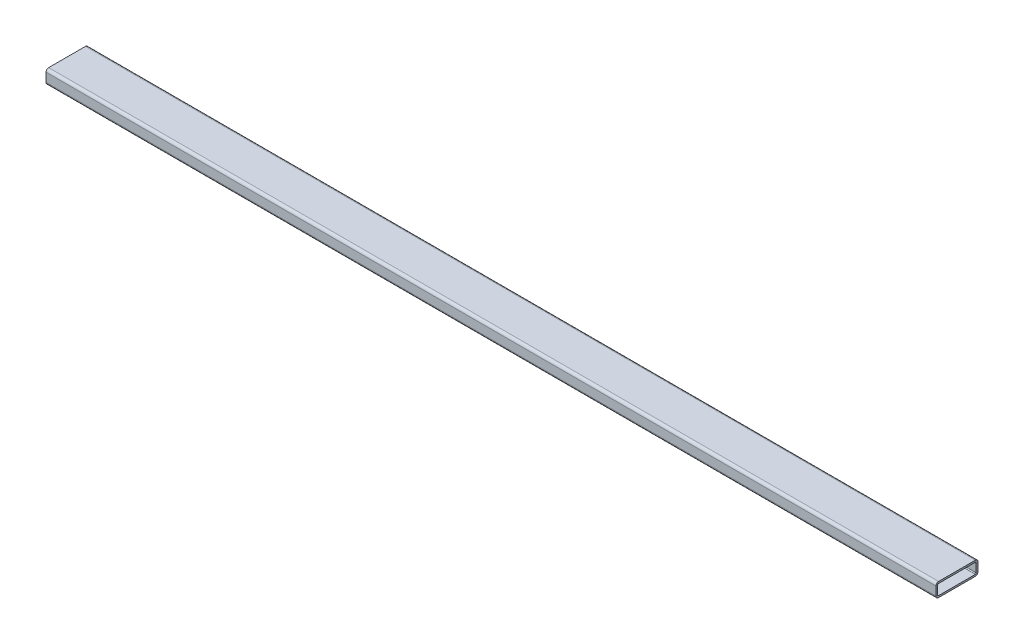
ISO-10303-21;
HEADER;
FILE_DESCRIPTION(('STEP AP214'),'2;1');
FILE_NAME('part.step','',(''),(''),'','','');
FILE_SCHEMA(('AUTOMOTIVE_DESIGN { 1 0 10303 214 1 1 1 1 }'));
ENDSEC;
DATA;
#1=APPLICATION_CONTEXT('core data for automotive mechanical design processes');
#2=APPLICATION_PROTOCOL_DEFINITION('international standard','automotive_design',2000,#1);
#3=PRODUCT_CONTEXT('',#1,'mechanical');
#4=PRODUCT('Part','Part','',(#3));
#5=PRODUCT_RELATED_PRODUCT_CATEGORY('part','',(#4));
#6=PRODUCT_DEFINITION_FORMATION('','',#4);
#7=PRODUCT_DEFINITION_CONTEXT('part definition',#1,'design');
#8=PRODUCT_DEFINITION('design','',#6,#7);
#9=PRODUCT_DEFINITION_SHAPE('','',#8);
#10=(LENGTH_UNIT() NAMED_UNIT(*) SI_UNIT(.MILLI.,.METRE.));
#11=(NAMED_UNIT(*) PLANE_ANGLE_UNIT() SI_UNIT($,.RADIAN.));
#12=(NAMED_UNIT(*) SI_UNIT($,.STERADIAN.) SOLID_ANGLE_UNIT());
#13=UNCERTAINTY_MEASURE_WITH_UNIT(LENGTH_MEASURE(1.E-05),#10,'distance_accuracy_value','');
#14=(GEOMETRIC_REPRESENTATION_CONTEXT(3) GLOBAL_UNCERTAINTY_ASSIGNED_CONTEXT((#13)) GLOBAL_UNIT_ASSIGNED_CONTEXT((#10,
#11,#12)) REPRESENTATION_CONTEXT('',''));
#15=CARTESIAN_POINT('',(0.,0.,0.));
#16=DIRECTION('',(0.,0.,1.));
#17=DIRECTION('',(1.,0.,0.));
#18=AXIS2_PLACEMENT_3D('',#15,#16,#17);
#19=CARTESIAN_POINT('',(806.45,20.6248,-33.3248));
#20=DIRECTION('',(1.,0.,0.));
#21=DIRECTION('',(0.,0.,-1.));
#22=AXIS2_PLACEMENT_3D('',#19,#20,#21);
#23=PLANE('',#22);
#24=CARTESIAN_POINT('',(806.45,20.6248,-33.3248));
#25=DIRECTION('',(1.,0.,0.));
#26=DIRECTION('',(0.,0.,-1.));
#27=AXIS2_PLACEMENT_3D('',#24,#25,#26);
#28=CIRCLE('',#27,4.77519999999999);
#29=CARTESIAN_POINT('',(806.45,20.6248,-38.1));
#30=VERTEX_POINT('',#29);
#31=CARTESIAN_POINT('',(806.45,25.4,-33.3248));
#32=VERTEX_POINT('',#31);
#33=EDGE_CURVE('E213',#30,#32,#28,.T.);
#34=ORIENTED_EDGE('',*,*,#33,.T.);
#35=DIRECTION('',(0.,0.,1.));
#36=VECTOR('',#35,1.);
#37=CARTESIAN_POINT('',(806.45,25.4,-33.3248));
#38=LINE('',#37,#36);
#39=CARTESIAN_POINT('',(806.45,25.4,33.3248));
#40=VERTEX_POINT('',#39);
#41=EDGE_CURVE('E216',#32,#40,#38,.T.);
#42=ORIENTED_EDGE('',*,*,#41,.T.);
#43=CARTESIAN_POINT('',(806.45,20.6248,33.3248));
#44=DIRECTION('',(1.,0.,0.));
#45=DIRECTION('',(0.,0.,1.));
#46=AXIS2_PLACEMENT_3D('',#43,#44,#45);
#47=CIRCLE('',#46,4.77519999999999);
#48=CARTESIAN_POINT('',(806.45,20.6248,38.1));
#49=VERTEX_POINT('',#48);
#50=EDGE_CURVE('E219',#40,#49,#47,.T.);
#51=ORIENTED_EDGE('',*,*,#50,.T.);
#52=DIRECTION('',(0.,-1.,0.));
#53=VECTOR('',#52,1.);
#54=CARTESIAN_POINT('',(806.45,20.6248,38.1));
#55=LINE('',#54,#53);
#56=CARTESIAN_POINT('',(806.45,4.77519999999999,38.1));
#57=VERTEX_POINT('',#56);
#58=EDGE_CURVE('E221',#49,#57,#55,.T.);
#59=ORIENTED_EDGE('',*,*,#58,.T.);
#60=CARTESIAN_POINT('',(806.45,4.77519999999999,33.3248));
#61=DIRECTION('',(1.,0.,0.));
#62=DIRECTION('',(0.,0.,1.));
#63=AXIS2_PLACEMENT_3D('',#60,#61,#62);
#64=CIRCLE('',#63,4.7752);
#65=CARTESIAN_POINT('',(806.45,0.,33.3248));
#66=VERTEX_POINT('',#65);
#67=EDGE_CURVE('E223',#57,#66,#64,.T.);
#68=ORIENTED_EDGE('',*,*,#67,.T.);
#69=DIRECTION('',(0.,0.,-1.));
#70=VECTOR('',#69,1.);
#71=CARTESIAN_POINT('',(806.45,0.,-33.3248));
#72=LINE('',#71,#70);
#73=CARTESIAN_POINT('',(806.45,0.,-33.3248));
#74=VERTEX_POINT('',#73);
#75=EDGE_CURVE('E225',#66,#74,#72,.T.);
#76=ORIENTED_EDGE('',*,*,#75,.T.);
#77=CARTESIAN_POINT('',(806.45,4.77520000000001,-33.3248));
#78=DIRECTION('',(1.,0.,0.));
#79=DIRECTION('',(0.,0.,1.));
#80=AXIS2_PLACEMENT_3D('',#77,#78,#79);
#81=CIRCLE('',#80,4.7752);
#82=CARTESIAN_POINT('',(806.45,4.77520000000001,-38.1));
#83=VERTEX_POINT('',#82);
#84=EDGE_CURVE('E227',#74,#83,#81,.T.);
#85=ORIENTED_EDGE('',*,*,#84,.T.);
#86=DIRECTION('',(0.,1.,0.));
#87=VECTOR('',#86,1.);
#88=CARTESIAN_POINT('',(806.45,20.6248,-38.1));
#89=LINE('',#88,#87);
#90=EDGE_CURVE('E229',#83,#30,#89,.T.);
#91=ORIENTED_EDGE('',*,*,#90,.T.);
#92=EDGE_LOOP('',(#34,#42,#51,#59,#68,#76,#85,#91));
#93=FACE_BOUND('',#92,.T.);
#94=DIRECTION('',(0.,0.,1.));
#95=VECTOR('',#94,1.);
#96=CARTESIAN_POINT('',(806.45,22.225,-33.3248));
#97=LINE('',#96,#95);
#98=CARTESIAN_POINT('',(806.45,22.225,-33.3248));
#99=VERTEX_POINT('',#98);
#100=CARTESIAN_POINT('',(806.45,22.225,33.3248));
#101=VERTEX_POINT('',#100);
#102=EDGE_CURVE('E156',#99,#101,#97,.T.);
#103=ORIENTED_EDGE('',*,*,#102,.F.);
#104=CARTESIAN_POINT('',(806.45,20.6248,-33.3248));
#105=DIRECTION('',(1.,0.,0.));
#106=DIRECTION('',(0.,0.,-1.));
#107=AXIS2_PLACEMENT_3D('',#104,#105,#106);
#108=CIRCLE('',#107,1.6002);
#109=CARTESIAN_POINT('',(806.45,20.6248,-34.925));
#110=VERTEX_POINT('',#109);
#111=EDGE_CURVE('E148',#110,#99,#108,.T.);
#112=ORIENTED_EDGE('',*,*,#111,.F.);
#113=DIRECTION('',(0.,1.,0.));
#114=VECTOR('',#113,1.);
#115=CARTESIAN_POINT('',(806.45,20.6248,-34.925));
#116=LINE('',#115,#114);
#117=CARTESIAN_POINT('',(806.45,4.77520000000001,-34.925));
#118=VERTEX_POINT('',#117);
#119=EDGE_CURVE('E181',#118,#110,#116,.T.);
#120=ORIENTED_EDGE('',*,*,#119,.F.);
#121=CARTESIAN_POINT('',(806.45,4.77520000000001,-33.3248));
#122=DIRECTION('',(1.,0.,0.));
#123=DIRECTION('',(0.,0.,1.));
#124=AXIS2_PLACEMENT_3D('',#121,#122,#123);
#125=CIRCLE('',#124,1.6002);
#126=CARTESIAN_POINT('',(806.45,3.17500000000001,-33.3248));
#127=VERTEX_POINT('',#126);
#128=EDGE_CURVE('E179',#127,#118,#125,.T.);
#129=ORIENTED_EDGE('',*,*,#128,.F.);
#130=DIRECTION('',(0.,0.,-1.));
#131=VECTOR('',#130,1.);
#132=CARTESIAN_POINT('',(806.45,3.17500000000001,-33.3248));
#133=LINE('',#132,#131);
#134=CARTESIAN_POINT('',(806.45,3.17499999999999,33.3248));
#135=VERTEX_POINT('',#134);
#136=EDGE_CURVE('E177',#135,#127,#133,.T.);
#137=ORIENTED_EDGE('',*,*,#136,.F.);
#138=CARTESIAN_POINT('',(806.45,4.77519999999999,33.3248));
#139=DIRECTION('',(1.,0.,0.));
#140=DIRECTION('',(0.,0.,1.));
#141=AXIS2_PLACEMENT_3D('',#138,#139,#140);
#142=CIRCLE('',#141,1.60020000000001);
#143=CARTESIAN_POINT('',(806.45,4.77519999999999,34.925));
#144=VERTEX_POINT('',#143);
#145=EDGE_CURVE('E175',#144,#135,#142,.T.);
#146=ORIENTED_EDGE('',*,*,#145,.F.);
#147=DIRECTION('',(0.,-1.,0.));
#148=VECTOR('',#147,1.);
#149=CARTESIAN_POINT('',(806.45,20.6248,34.925));
#150=LINE('',#149,#148);
#151=CARTESIAN_POINT('',(806.45,20.6248,34.925));
#152=VERTEX_POINT('',#151);
#153=EDGE_CURVE('E171',#152,#144,#150,.T.);
#154=ORIENTED_EDGE('',*,*,#153,.F.);
#155=CARTESIAN_POINT('',(806.45,20.6248,33.3248));
#156=DIRECTION('',(1.,0.,0.));
#157=DIRECTION('',(0.,0.,1.));
#158=AXIS2_PLACEMENT_3D('',#155,#156,#157);
#159=CIRCLE('',#158,1.60020000000001);
#160=EDGE_CURVE('E169',#101,#152,#159,.T.);
#161=ORIENTED_EDGE('',*,*,#160,.F.);
#162=EDGE_LOOP('',(#103,#112,#120,#129,#137,#146,#154,#161));
#163=FACE_BOUND('',#162,.T.);
#164=ADVANCED_FACE('F35',(#93,#163),#23,.T.);
#165=CARTESIAN_POINT('',(-806.45,20.6248,-33.3248));
#166=DIRECTION('',(1.,0.,0.));
#167=DIRECTION('',(0.,0.,-1.));
#168=AXIS2_PLACEMENT_3D('',#165,#166,#167);
#169=PLANE('',#168);
#170=CARTESIAN_POINT('',(-806.45,20.6248,-33.3248));
#171=DIRECTION('',(1.,0.,0.));
#172=DIRECTION('',(0.,0.,-1.));
#173=AXIS2_PLACEMENT_3D('',#170,#171,#172);
#174=CIRCLE('',#173,4.77519999999999);
#175=CARTESIAN_POINT('',(-806.45,20.6248,-38.1));
#176=VERTEX_POINT('',#175);
#177=CARTESIAN_POINT('',(-806.45,25.4,-33.3248));
#178=VERTEX_POINT('',#177);
#179=EDGE_CURVE('E164',#176,#178,#174,.T.);
#180=ORIENTED_EDGE('',*,*,#179,.F.);
#181=DIRECTION('',(0.,1.,0.));
#182=VECTOR('',#181,1.);
#183=CARTESIAN_POINT('',(-806.45,20.6248,-38.1));
#184=LINE('',#183,#182);
#185=CARTESIAN_POINT('',(-806.45,4.77520000000001,-38.1));
#186=VERTEX_POINT('',#185);
#187=EDGE_CURVE('E217',#186,#176,#184,.T.);
#188=ORIENTED_EDGE('',*,*,#187,.F.);
#189=CARTESIAN_POINT('',(-806.45,4.77520000000001,-33.3248));
#190=DIRECTION('',(1.,0.,0.));
#191=DIRECTION('',(0.,0.,1.));
#192=AXIS2_PLACEMENT_3D('',#189,#190,#191);
#193=CIRCLE('',#192,4.7752);
#194=CARTESIAN_POINT('',(-806.45,0.,-33.3248));
#195=VERTEX_POINT('',#194);
#196=EDGE_CURVE('E244',#195,#186,#193,.T.);
#197=ORIENTED_EDGE('',*,*,#196,.F.);
#198=DIRECTION('',(0.,0.,-1.));
#199=VECTOR('',#198,1.);
#200=CARTESIAN_POINT('',(-806.45,0.,-33.3248));
#201=LINE('',#200,#199);
#202=CARTESIAN_POINT('',(-806.45,0.,33.3248));
#203=VERTEX_POINT('',#202);
#204=EDGE_CURVE('E242',#203,#195,#201,.T.);
#205=ORIENTED_EDGE('',*,*,#204,.F.);
#206=CARTESIAN_POINT('',(-806.45,4.77519999999999,33.3248));
#207=DIRECTION('',(1.,0.,0.));
#208=DIRECTION('',(0.,0.,1.));
#209=AXIS2_PLACEMENT_3D('',#206,#207,#208);
#210=CIRCLE('',#209,4.7752);
#211=CARTESIAN_POINT('',(-806.45,4.77519999999999,38.1));
#212=VERTEX_POINT('',#211);
#213=EDGE_CURVE('E240',#212,#203,#210,.T.);
#214=ORIENTED_EDGE('',*,*,#213,.F.);
#215=DIRECTION('',(0.,-1.,0.));
#216=VECTOR('',#215,1.);
#217=CARTESIAN_POINT('',(-806.45,20.6248,38.1));
#218=LINE('',#217,#216);
#219=CARTESIAN_POINT('',(-806.45,20.6248,38.1));
#220=VERTEX_POINT('',#219);
#221=EDGE_CURVE('E238',#220,#212,#218,.T.);
#222=ORIENTED_EDGE('',*,*,#221,.F.);
#223=CARTESIAN_POINT('',(-806.45,20.6248,33.3248));
#224=DIRECTION('',(1.,0.,0.));
#225=DIRECTION('',(0.,0.,1.));
#226=AXIS2_PLACEMENT_3D('',#223,#224,#225);
#227=CIRCLE('',#226,4.77519999999999);
#228=CARTESIAN_POINT('',(-806.45,25.4,33.3248));
#229=VERTEX_POINT('',#228);
#230=EDGE_CURVE('E236',#229,#220,#227,.T.);
#231=ORIENTED_EDGE('',*,*,#230,.F.);
#232=DIRECTION('',(0.,0.,1.));
#233=VECTOR('',#232,1.);
#234=CARTESIAN_POINT('',(-806.45,25.4,-33.3248));
#235=LINE('',#234,#233);
#236=EDGE_CURVE('E234',#178,#229,#235,.T.);
#237=ORIENTED_EDGE('',*,*,#236,.F.);
#238=EDGE_LOOP('',(#180,#188,#197,#205,#214,#222,#231,#237));
#239=FACE_BOUND('',#238,.T.);
#240=CARTESIAN_POINT('',(-806.45,20.6248,-33.3248));
#241=DIRECTION('',(1.,0.,0.));
#242=DIRECTION('',(0.,0.,-1.));
#243=AXIS2_PLACEMENT_3D('',#240,#241,#242);
#244=CIRCLE('',#243,1.6002);
#245=CARTESIAN_POINT('',(-806.45,20.6248,-34.925));
#246=VERTEX_POINT('',#245);
#247=CARTESIAN_POINT('',(-806.45,22.225,-33.3248));
#248=VERTEX_POINT('',#247);
#249=EDGE_CURVE('E58',#246,#248,#244,.T.);
#250=ORIENTED_EDGE('',*,*,#249,.T.);
#251=DIRECTION('',(0.,0.,1.));
#252=VECTOR('',#251,1.);
#253=CARTESIAN_POINT('',(-806.45,22.225,-33.3248));
#254=LINE('',#253,#252);
#255=CARTESIAN_POINT('',(-806.45,22.225,33.3248));
#256=VERTEX_POINT('',#255);
#257=EDGE_CURVE('E163',#248,#256,#254,.T.);
#258=ORIENTED_EDGE('',*,*,#257,.T.);
#259=CARTESIAN_POINT('',(-806.45,20.6248,33.3248));
#260=DIRECTION('',(1.,0.,0.));
#261=DIRECTION('',(0.,0.,1.));
#262=AXIS2_PLACEMENT_3D('',#259,#260,#261);
#263=CIRCLE('',#262,1.60020000000001);
#264=CARTESIAN_POINT('',(-806.45,20.6248,34.925));
#265=VERTEX_POINT('',#264);
#266=EDGE_CURVE('E185',#256,#265,#263,.T.);
#267=ORIENTED_EDGE('',*,*,#266,.T.);
#268=DIRECTION('',(0.,-1.,0.));
#269=VECTOR('',#268,1.);
#270=CARTESIAN_POINT('',(-806.45,20.6248,34.925));
#271=LINE('',#270,#269);
#272=CARTESIAN_POINT('',(-806.45,4.77519999999999,34.925));
#273=VERTEX_POINT('',#272);
#274=EDGE_CURVE('E188',#265,#273,#271,.T.);
#275=ORIENTED_EDGE('',*,*,#274,.T.);
#276=CARTESIAN_POINT('',(-806.45,4.77519999999999,33.3248));
#277=DIRECTION('',(1.,0.,0.));
#278=DIRECTION('',(0.,0.,1.));
#279=AXIS2_PLACEMENT_3D('',#276,#277,#278);
#280=CIRCLE('',#279,1.60020000000001);
#281=CARTESIAN_POINT('',(-806.45,3.17499999999999,33.3248));
#282=VERTEX_POINT('',#281);
#283=EDGE_CURVE('E191',#273,#282,#280,.T.);
#284=ORIENTED_EDGE('',*,*,#283,.T.);
#285=DIRECTION('',(0.,0.,-1.));
#286=VECTOR('',#285,1.);
#287=CARTESIAN_POINT('',(-806.45,3.17500000000001,-33.3248));
#288=LINE('',#287,#286);
#289=CARTESIAN_POINT('',(-806.45,3.17500000000001,-33.3248));
#290=VERTEX_POINT('',#289);
#291=EDGE_CURVE('E194',#282,#290,#288,.T.);
#292=ORIENTED_EDGE('',*,*,#291,.T.);
#293=CARTESIAN_POINT('',(-806.45,4.77520000000001,-33.3248));
#294=DIRECTION('',(1.,0.,0.));
#295=DIRECTION('',(0.,0.,1.));
#296=AXIS2_PLACEMENT_3D('',#293,#294,#295);
#297=CIRCLE('',#296,1.6002);
#298=CARTESIAN_POINT('',(-806.45,4.77520000000001,-34.925));
#299=VERTEX_POINT('',#298);
#300=EDGE_CURVE('E197',#290,#299,#297,.T.);
#301=ORIENTED_EDGE('',*,*,#300,.T.);
#302=DIRECTION('',(0.,1.,0.));
#303=VECTOR('',#302,1.);
#304=CARTESIAN_POINT('',(-806.45,20.6248,-34.925));
#305=LINE('',#304,#303);
#306=EDGE_CURVE('E157',#299,#246,#305,.T.);
#307=ORIENTED_EDGE('',*,*,#306,.T.);
#308=EDGE_LOOP('',(#250,#258,#267,#275,#284,#292,#301,#307));
#309=FACE_BOUND('',#308,.T.);
#310=ADVANCED_FACE('F274',(#239,#309),#169,.F.);
#311=CARTESIAN_POINT('',(806.45,20.6248,-33.3248));
#312=DIRECTION('',(-1.,0.,0.));
#313=DIRECTION('',(0.,0.,1.));
#314=AXIS2_PLACEMENT_3D('',#311,#312,#313);
#315=CYLINDRICAL_SURFACE('',#314,4.77519999999999);
#316=ORIENTED_EDGE('',*,*,#179,.T.);
#317=DIRECTION('',(-1.,0.,0.));
#318=VECTOR('',#317,1.);
#319=CARTESIAN_POINT('',(806.45,25.4,-33.3248));
#320=LINE('',#319,#318);
#321=EDGE_CURVE('E11',#32,#178,#320,.T.);
#322=ORIENTED_EDGE('',*,*,#321,.F.);
#323=ORIENTED_EDGE('',*,*,#33,.F.);
#324=DIRECTION('',(-1.,0.,0.));
#325=VECTOR('',#324,1.);
#326=CARTESIAN_POINT('',(806.45,20.6248,-38.1));
#327=LINE('',#326,#325);
#328=EDGE_CURVE('E231',#30,#176,#327,.T.);
#329=ORIENTED_EDGE('',*,*,#328,.T.);
#330=EDGE_LOOP('',(#316,#322,#323,#329));
#331=FACE_BOUND('',#330,.T.);
#332=ADVANCED_FACE('F37',(#331),#315,.T.);
#333=CARTESIAN_POINT('',(806.45,25.4,-33.3248));
#334=DIRECTION('',(0.,-1.,0.));
#335=DIRECTION('',(0.,0.,-1.));
#336=AXIS2_PLACEMENT_3D('',#333,#334,#335);
#337=PLANE('',#336);
#338=ORIENTED_EDGE('',*,*,#236,.T.);
#339=DIRECTION('',(-1.,0.,0.));
#340=VECTOR('',#339,1.);
#341=CARTESIAN_POINT('',(806.45,25.4,33.3248));
#342=LINE('',#341,#340);
#343=EDGE_CURVE('E43',#40,#229,#342,.T.);
#344=ORIENTED_EDGE('',*,*,#343,.F.);
#345=ORIENTED_EDGE('',*,*,#41,.F.);
#346=ORIENTED_EDGE('',*,*,#321,.T.);
#347=EDGE_LOOP('',(#338,#344,#345,#346));
#348=FACE_BOUND('',#347,.T.);
#349=ADVANCED_FACE('F291',(#348),#337,.F.);
#350=CARTESIAN_POINT('',(806.45,20.6248,33.3248));
#351=DIRECTION('',(-1.,0.,0.));
#352=DIRECTION('',(0.,0.,1.));
#353=AXIS2_PLACEMENT_3D('',#350,#351,#352);
#354=CYLINDRICAL_SURFACE('',#353,4.77519999999999);
#355=ORIENTED_EDGE('',*,*,#230,.T.);
#356=DIRECTION('',(-1.,0.,0.));
#357=VECTOR('',#356,1.);
#358=CARTESIAN_POINT('',(806.45,20.6248,38.1));
#359=LINE('',#358,#357);
#360=EDGE_CURVE('E261',#49,#220,#359,.T.);
#361=ORIENTED_EDGE('',*,*,#360,.F.);
#362=ORIENTED_EDGE('',*,*,#50,.F.);
#363=ORIENTED_EDGE('',*,*,#343,.T.);
#364=EDGE_LOOP('',(#355,#361,#362,#363));
#365=FACE_BOUND('',#364,.T.);
#366=ADVANCED_FACE('F268',(#365),#354,.T.);
#367=CARTESIAN_POINT('',(806.45,20.6248,38.1));
#368=DIRECTION('',(0.,0.,-1.));
#369=DIRECTION('',(0.,1.,0.));
#370=AXIS2_PLACEMENT_3D('',#367,#368,#369);
#371=PLANE('',#370);
#372=ORIENTED_EDGE('',*,*,#221,.T.);
#373=DIRECTION('',(-1.,0.,0.));
#374=VECTOR('',#373,1.);
#375=CARTESIAN_POINT('',(806.45,4.77519999999999,38.1));
#376=LINE('',#375,#374);
#377=EDGE_CURVE('E258',#57,#212,#376,.T.);
#378=ORIENTED_EDGE('',*,*,#377,.F.);
#379=ORIENTED_EDGE('',*,*,#58,.F.);
#380=ORIENTED_EDGE('',*,*,#360,.T.);
#381=EDGE_LOOP('',(#372,#378,#379,#380));
#382=FACE_BOUND('',#381,.T.);
#383=ADVANCED_FACE('F280',(#382),#371,.F.);
#384=CARTESIAN_POINT('',(806.45,4.77519999999999,33.3248));
#385=DIRECTION('',(-1.,0.,0.));
#386=DIRECTION('',(0.,0.,1.));
#387=AXIS2_PLACEMENT_3D('',#384,#385,#386);
#388=CYLINDRICAL_SURFACE('',#387,4.7752);
#389=ORIENTED_EDGE('',*,*,#213,.T.);
#390=DIRECTION('',(-1.,0.,0.));
#391=VECTOR('',#390,1.);
#392=CARTESIAN_POINT('',(806.45,0.,33.3248));
#393=LINE('',#392,#391);
#394=EDGE_CURVE('E255',#66,#203,#393,.T.);
#395=ORIENTED_EDGE('',*,*,#394,.F.);
#396=ORIENTED_EDGE('',*,*,#67,.F.);
#397=ORIENTED_EDGE('',*,*,#377,.T.);
#398=EDGE_LOOP('',(#389,#395,#396,#397));
#399=FACE_BOUND('',#398,.T.);
#400=ADVANCED_FACE('F284',(#399),#388,.T.);
#401=CARTESIAN_POINT('',(806.45,0.,-33.3248));
#402=DIRECTION('',(0.,1.,0.));
#403=DIRECTION('',(0.,0.,1.));
#404=AXIS2_PLACEMENT_3D('',#401,#402,#403);
#405=PLANE('',#404);
#406=ORIENTED_EDGE('',*,*,#204,.T.);
#407=DIRECTION('',(-1.,0.,0.));
#408=VECTOR('',#407,1.);
#409=CARTESIAN_POINT('',(806.45,0.,-33.3248));
#410=LINE('',#409,#408);
#411=EDGE_CURVE('E252',#74,#195,#410,.T.);
#412=ORIENTED_EDGE('',*,*,#411,.F.);
#413=ORIENTED_EDGE('',*,*,#75,.F.);
#414=ORIENTED_EDGE('',*,*,#394,.T.);
#415=EDGE_LOOP('',(#406,#412,#413,#414));
#416=FACE_BOUND('',#415,.T.);
#417=ADVANCED_FACE('F304',(#416),#405,.F.);
#418=CARTESIAN_POINT('',(806.45,4.77520000000001,-33.3248));
#419=DIRECTION('',(-1.,0.,0.));
#420=DIRECTION('',(0.,0.,1.));
#421=AXIS2_PLACEMENT_3D('',#418,#419,#420);
#422=CYLINDRICAL_SURFACE('',#421,4.7752);
#423=ORIENTED_EDGE('',*,*,#196,.T.);
#424=DIRECTION('',(-1.,0.,0.));
#425=VECTOR('',#424,1.);
#426=CARTESIAN_POINT('',(806.45,4.77520000000001,-38.1));
#427=LINE('',#426,#425);
#428=EDGE_CURVE('E249',#83,#186,#427,.T.);
#429=ORIENTED_EDGE('',*,*,#428,.F.);
#430=ORIENTED_EDGE('',*,*,#84,.F.);
#431=ORIENTED_EDGE('',*,*,#411,.T.);
#432=EDGE_LOOP('',(#423,#429,#430,#431));
#433=FACE_BOUND('',#432,.T.);
#434=ADVANCED_FACE('F302',(#433),#422,.T.);
#435=CARTESIAN_POINT('',(806.45,20.6248,-38.1));
#436=DIRECTION('',(0.,0.,1.));
#437=DIRECTION('',(0.,-1.,0.));
#438=AXIS2_PLACEMENT_3D('',#435,#436,#437);
#439=PLANE('',#438);
#440=ORIENTED_EDGE('',*,*,#187,.T.);
#441=ORIENTED_EDGE('',*,*,#328,.F.);
#442=ORIENTED_EDGE('',*,*,#90,.F.);
#443=ORIENTED_EDGE('',*,*,#428,.T.);
#444=EDGE_LOOP('',(#440,#441,#442,#443));
#445=FACE_BOUND('',#444,.T.);
#446=ADVANCED_FACE('F297',(#445),#439,.F.);
#447=CARTESIAN_POINT('',(806.45,20.6248,-33.3248));
#448=DIRECTION('',(-1.,0.,0.));
#449=DIRECTION('',(0.,0.,1.));
#450=AXIS2_PLACEMENT_3D('',#447,#448,#449);
#451=CYLINDRICAL_SURFACE('',#450,1.6002);
#452=ORIENTED_EDGE('',*,*,#249,.F.);
#453=DIRECTION('',(-1.,0.,0.));
#454=VECTOR('',#453,1.);
#455=CARTESIAN_POINT('',(806.45,20.6248,-34.925));
#456=LINE('',#455,#454);
#457=EDGE_CURVE('E152',#110,#246,#456,.T.);
#458=ORIENTED_EDGE('',*,*,#457,.F.);
#459=ORIENTED_EDGE('',*,*,#111,.T.);
#460=DIRECTION('',(-1.,0.,0.));
#461=VECTOR('',#460,1.);
#462=CARTESIAN_POINT('',(806.45,22.225,-33.3248));
#463=LINE('',#462,#461);
#464=EDGE_CURVE('E151',#99,#248,#463,.T.);
#465=ORIENTED_EDGE('',*,*,#464,.T.);
#466=EDGE_LOOP('',(#452,#458,#459,#465));
#467=FACE_BOUND('',#466,.T.);
#468=ADVANCED_FACE('F150',(#467),#451,.F.);
#469=CARTESIAN_POINT('',(806.45,22.225,-33.3248));
#470=DIRECTION('',(0.,-1.,0.));
#471=DIRECTION('',(0.,0.,-1.));
#472=AXIS2_PLACEMENT_3D('',#469,#470,#471);
#473=PLANE('',#472);
#474=ORIENTED_EDGE('',*,*,#257,.F.);
#475=ORIENTED_EDGE('',*,*,#464,.F.);
#476=ORIENTED_EDGE('',*,*,#102,.T.);
#477=DIRECTION('',(-1.,0.,0.));
#478=VECTOR('',#477,1.);
#479=CARTESIAN_POINT('',(806.45,22.225,33.3248));
#480=LINE('',#479,#478);
#481=EDGE_CURVE('E165',#101,#256,#480,.T.);
#482=ORIENTED_EDGE('',*,*,#481,.T.);
#483=EDGE_LOOP('',(#474,#475,#476,#482));
#484=FACE_BOUND('',#483,.T.);
#485=ADVANCED_FACE('F160',(#484),#473,.T.);
#486=CARTESIAN_POINT('',(806.45,20.6248,33.3248));
#487=DIRECTION('',(-1.,0.,0.));
#488=DIRECTION('',(0.,0.,1.));
#489=AXIS2_PLACEMENT_3D('',#486,#487,#488);
#490=CYLINDRICAL_SURFACE('',#489,1.60020000000001);
#491=ORIENTED_EDGE('',*,*,#266,.F.);
#492=ORIENTED_EDGE('',*,*,#481,.F.);
#493=ORIENTED_EDGE('',*,*,#160,.T.);
#494=DIRECTION('',(-1.,0.,0.));
#495=VECTOR('',#494,1.);
#496=CARTESIAN_POINT('',(806.45,20.6248,34.925));
#497=LINE('',#496,#495);
#498=EDGE_CURVE('E210',#152,#265,#497,.T.);
#499=ORIENTED_EDGE('',*,*,#498,.T.);
#500=EDGE_LOOP('',(#491,#492,#493,#499));
#501=FACE_BOUND('',#500,.T.);
#502=ADVANCED_FACE('F329',(#501),#490,.F.);
#503=CARTESIAN_POINT('',(806.45,20.6248,34.925));
#504=DIRECTION('',(0.,0.,-1.));
#505=DIRECTION('',(-1.,0.,0.));
#506=AXIS2_PLACEMENT_3D('',#503,#504,#505);
#507=PLANE('',#506);
#508=ORIENTED_EDGE('',*,*,#274,.F.);
#509=ORIENTED_EDGE('',*,*,#498,.F.);
#510=ORIENTED_EDGE('',*,*,#153,.T.);
#511=DIRECTION('',(-1.,0.,0.));
#512=VECTOR('',#511,1.);
#513=CARTESIAN_POINT('',(806.45,4.77519999999999,34.925));
#514=LINE('',#513,#512);
#515=EDGE_CURVE('E208',#144,#273,#514,.T.);
#516=ORIENTED_EDGE('',*,*,#515,.T.);
#517=EDGE_LOOP('',(#508,#509,#510,#516));
#518=FACE_BOUND('',#517,.T.);
#519=ADVANCED_FACE('F333',(#518),#507,.T.);
#520=CARTESIAN_POINT('',(806.45,4.77519999999999,33.3248));
#521=DIRECTION('',(-1.,0.,0.));
#522=DIRECTION('',(0.,0.,1.));
#523=AXIS2_PLACEMENT_3D('',#520,#521,#522);
#524=CYLINDRICAL_SURFACE('',#523,1.60020000000001);
#525=ORIENTED_EDGE('',*,*,#283,.F.);
#526=ORIENTED_EDGE('',*,*,#515,.F.);
#527=ORIENTED_EDGE('',*,*,#145,.T.);
#528=DIRECTION('',(-1.,0.,0.));
#529=VECTOR('',#528,1.);
#530=CARTESIAN_POINT('',(806.45,3.17499999999999,33.3248));
#531=LINE('',#530,#529);
#532=EDGE_CURVE('E206',#135,#282,#531,.T.);
#533=ORIENTED_EDGE('',*,*,#532,.T.);
#534=EDGE_LOOP('',(#525,#526,#527,#533));
#535=FACE_BOUND('',#534,.T.);
#536=ADVANCED_FACE('F339',(#535),#524,.F.);
#537=CARTESIAN_POINT('',(806.45,3.17500000000001,-33.3248));
#538=DIRECTION('',(0.,1.,0.));
#539=DIRECTION('',(0.,0.,1.));
#540=AXIS2_PLACEMENT_3D('',#537,#538,#539);
#541=PLANE('',#540);
#542=ORIENTED_EDGE('',*,*,#291,.F.);
#543=ORIENTED_EDGE('',*,*,#532,.F.);
#544=ORIENTED_EDGE('',*,*,#136,.T.);
#545=DIRECTION('',(-1.,0.,0.));
#546=VECTOR('',#545,1.);
#547=CARTESIAN_POINT('',(806.45,3.17500000000001,-33.3248));
#548=LINE('',#547,#546);
#549=EDGE_CURVE('E204',#127,#290,#548,.T.);
#550=ORIENTED_EDGE('',*,*,#549,.T.);
#551=EDGE_LOOP('',(#542,#543,#544,#550));
#552=FACE_BOUND('',#551,.T.);
#553=ADVANCED_FACE('F343',(#552),#541,.T.);
#554=CARTESIAN_POINT('',(806.45,4.77520000000001,-33.3248));
#555=DIRECTION('',(-1.,0.,0.));
#556=DIRECTION('',(0.,0.,1.));
#557=AXIS2_PLACEMENT_3D('',#554,#555,#556);
#558=CYLINDRICAL_SURFACE('',#557,1.6002);
#559=ORIENTED_EDGE('',*,*,#300,.F.);
#560=ORIENTED_EDGE('',*,*,#549,.F.);
#561=ORIENTED_EDGE('',*,*,#128,.T.);
#562=DIRECTION('',(-1.,0.,0.));
#563=VECTOR('',#562,1.);
#564=CARTESIAN_POINT('',(806.45,4.77520000000001,-34.925));
#565=LINE('',#564,#563);
#566=EDGE_CURVE('E50',#118,#299,#565,.T.);
#567=ORIENTED_EDGE('',*,*,#566,.T.);
#568=EDGE_LOOP('',(#559,#560,#561,#567));
#569=FACE_BOUND('',#568,.T.);
#570=ADVANCED_FACE('F347',(#569),#558,.F.);
#571=CARTESIAN_POINT('',(806.45,20.6248,-34.925));
#572=DIRECTION('',(0.,0.,1.));
#573=DIRECTION('',(0.,-1.,0.));
#574=AXIS2_PLACEMENT_3D('',#571,#572,#573);
#575=PLANE('',#574);
#576=ORIENTED_EDGE('',*,*,#306,.F.);
#577=ORIENTED_EDGE('',*,*,#566,.F.);
#578=ORIENTED_EDGE('',*,*,#119,.T.);
#579=ORIENTED_EDGE('',*,*,#457,.T.);
#580=EDGE_LOOP('',(#576,#577,#578,#579));
#581=FACE_BOUND('',#580,.T.);
#582=ADVANCED_FACE('F351',(#581),#575,.T.);
#583=CLOSED_SHELL('',(#164,#310,#332,#349,#366,#383,#400,#417,#434,#446,#468,#485,#502,#519,
#536,#553,#570,#582));
#584=MANIFOLD_SOLID_BREP('B2',#583);
#585=ADVANCED_BREP_SHAPE_REPRESENTATION('',(#18,#584),#14);
#586=SHAPE_DEFINITION_REPRESENTATION(#9,#585);
ENDSEC;
END-ISO-10303-21;
